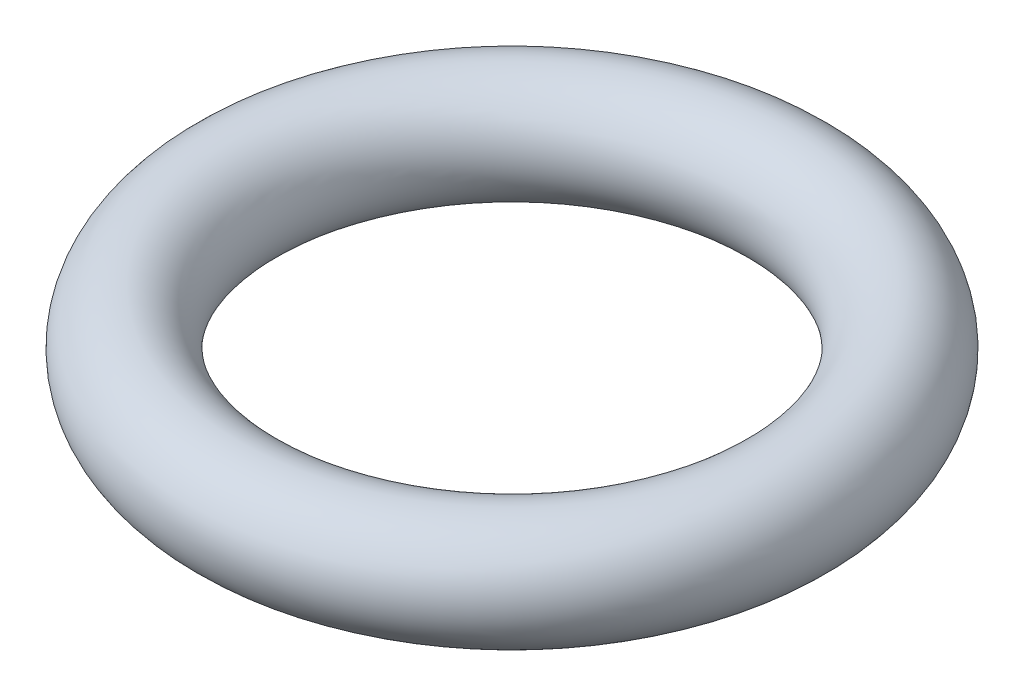
ISO-10303-21;
HEADER;
FILE_DESCRIPTION(('STEP AP214'),'2;1');
FILE_NAME('part.step','',(''),(''),'','','');
FILE_SCHEMA(('AUTOMOTIVE_DESIGN { 1 0 10303 214 1 1 1 1 }'));
ENDSEC;
DATA;
#1=APPLICATION_CONTEXT('core data for automotive mechanical design processes');
#2=APPLICATION_PROTOCOL_DEFINITION('international standard','automotive_design',2000,#1);
#3=PRODUCT_CONTEXT('',#1,'mechanical');
#4=PRODUCT('Part','Part','',(#3));
#5=PRODUCT_RELATED_PRODUCT_CATEGORY('part','',(#4));
#6=PRODUCT_DEFINITION_FORMATION('','',#4);
#7=PRODUCT_DEFINITION_CONTEXT('part definition',#1,'design');
#8=PRODUCT_DEFINITION('design','',#6,#7);
#9=PRODUCT_DEFINITION_SHAPE('','',#8);
#10=(LENGTH_UNIT() NAMED_UNIT(*) SI_UNIT(.MILLI.,.METRE.));
#11=(NAMED_UNIT(*) PLANE_ANGLE_UNIT() SI_UNIT($,.RADIAN.));
#12=(NAMED_UNIT(*) SI_UNIT($,.STERADIAN.) SOLID_ANGLE_UNIT());
#13=UNCERTAINTY_MEASURE_WITH_UNIT(LENGTH_MEASURE(1.E-05),#10,'distance_accuracy_value','');
#14=(GEOMETRIC_REPRESENTATION_CONTEXT(3) GLOBAL_UNCERTAINTY_ASSIGNED_CONTEXT((#13)) GLOBAL_UNIT_ASSIGNED_CONTEXT((#10,
#11,#12)) REPRESENTATION_CONTEXT('',''));
#15=CARTESIAN_POINT('',(0.,0.,0.));
#16=DIRECTION('',(0.,0.,1.));
#17=DIRECTION('',(1.,0.,0.));
#18=AXIS2_PLACEMENT_3D('',#15,#16,#17);
#19=CARTESIAN_POINT('',(0.,0.,0.));
#20=DIRECTION('',(0.,-1.,0.));
#21=DIRECTION('',(0.,0.,-1.));
#22=AXIS2_PLACEMENT_3D('',#19,#20,#21);
#23=TOROIDAL_SURFACE('',#22,9.95235127210249,2.);
#24=CARTESIAN_POINT('',(0.,0.,-11.9523512721025));
#25=VERTEX_POINT('',#24);
#26=VERTEX_LOOP('',#25);
#27=FACE_BOUND('',#26,.T.);
#28=ADVANCED_FACE('F31',(#27),#23,.T.);
#29=CLOSED_SHELL('',(#28));
#30=MANIFOLD_SOLID_BREP('B2',#29);
#31=ADVANCED_BREP_SHAPE_REPRESENTATION('',(#18,#30),#14);
#32=SHAPE_DEFINITION_REPRESENTATION(#9,#31);
ENDSEC;
END-ISO-10303-21;
